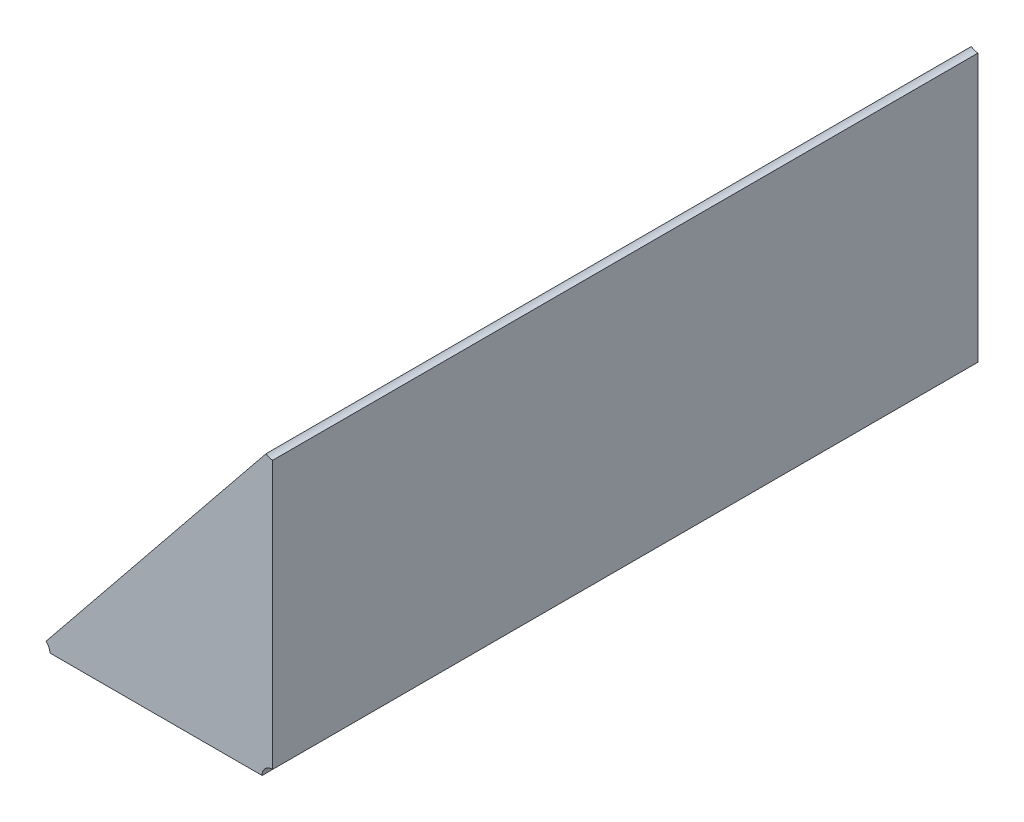
ISO-10303-21;
HEADER;
FILE_DESCRIPTION(('STEP AP214'),'2;1');
FILE_NAME('part.step','',(''),(''),'','','');
FILE_SCHEMA(('AUTOMOTIVE_DESIGN { 1 0 10303 214 1 1 1 1 }'));
ENDSEC;
DATA;
#1=APPLICATION_CONTEXT('core data for automotive mechanical design processes');
#2=APPLICATION_PROTOCOL_DEFINITION('international standard','automotive_design',2000,#1);
#3=PRODUCT_CONTEXT('',#1,'mechanical');
#4=PRODUCT('Part','Part','',(#3));
#5=PRODUCT_RELATED_PRODUCT_CATEGORY('part','',(#4));
#6=PRODUCT_DEFINITION_FORMATION('','',#4);
#7=PRODUCT_DEFINITION_CONTEXT('part definition',#1,'design');
#8=PRODUCT_DEFINITION('design','',#6,#7);
#9=PRODUCT_DEFINITION_SHAPE('','',#8);
#10=(LENGTH_UNIT() NAMED_UNIT(*) SI_UNIT(.MILLI.,.METRE.));
#11=(NAMED_UNIT(*) PLANE_ANGLE_UNIT() SI_UNIT($,.RADIAN.));
#12=(NAMED_UNIT(*) SI_UNIT($,.STERADIAN.) SOLID_ANGLE_UNIT());
#13=UNCERTAINTY_MEASURE_WITH_UNIT(LENGTH_MEASURE(1.E-05),#10,'distance_accuracy_value','');
#14=(GEOMETRIC_REPRESENTATION_CONTEXT(3) GLOBAL_UNCERTAINTY_ASSIGNED_CONTEXT((#13)) GLOBAL_UNIT_ASSIGNED_CONTEXT((#10,
#11,#12)) REPRESENTATION_CONTEXT('',''));
#15=CARTESIAN_POINT('',(0.,0.,0.));
#16=DIRECTION('',(0.,0.,1.));
#17=DIRECTION('',(1.,0.,0.));
#18=AXIS2_PLACEMENT_3D('',#15,#16,#17);
#19=CARTESIAN_POINT('',(-0.904883488962386,-0.778912469373211,0.1));
#20=DIRECTION('',(0.,0.,1.));
#21=DIRECTION('',(-1.,0.,0.));
#22=AXIS2_PLACEMENT_3D('',#19,#20,#21);
#23=CYLINDRICAL_SURFACE('',#22,0.0015);
#24=DIRECTION('',(0.,0.,1.));
#25=VECTOR('',#24,1.);
#26=CARTESIAN_POINT('',(-0.90394105514971,-0.777745499575518,0.));
#27=LINE('',#26,#25);
#28=CARTESIAN_POINT('',(-0.90394105514971,-0.777745499575518,0.));
#29=VERTEX_POINT('',#28);
#30=CARTESIAN_POINT('',(-0.90394105514971,-0.777745499575518,0.1));
#31=VERTEX_POINT('',#30);
#32=EDGE_CURVE('E11',#29,#31,#27,.T.);
#33=ORIENTED_EDGE('',*,*,#32,.F.);
#34=CARTESIAN_POINT('',(-0.904883488962386,-0.778912469373211,0.));
#35=DIRECTION('',(0.,0.,1.));
#36=DIRECTION('',(1.,0.,0.));
#37=AXIS2_PLACEMENT_3D('',#34,#35,#36);
#38=CIRCLE('',#37,0.0015);
#39=CARTESIAN_POINT('',(-0.903383488962386,-0.778912469373211,0.));
#40=VERTEX_POINT('',#39);
#41=EDGE_CURVE('E72',#40,#29,#38,.T.);
#42=ORIENTED_EDGE('',*,*,#41,.F.);
#43=DIRECTION('',(0.,0.,-1.));
#44=VECTOR('',#43,1.);
#45=CARTESIAN_POINT('',(-0.903383488962386,-0.778912469373211,0.1));
#46=LINE('',#45,#44);
#47=CARTESIAN_POINT('',(-0.903383488962386,-0.778912469373211,0.1));
#48=VERTEX_POINT('',#47);
#49=EDGE_CURVE('E94',#48,#40,#46,.T.);
#50=ORIENTED_EDGE('',*,*,#49,.F.);
#51=CARTESIAN_POINT('',(-0.904883488962386,-0.778912469373211,0.1));
#52=DIRECTION('',(0.,0.,-1.));
#53=DIRECTION('',(0.628289208450276,0.777979865128222,0.));
#54=AXIS2_PLACEMENT_3D('',#51,#52,#53);
#55=CIRCLE('',#54,0.0015);
#56=EDGE_CURVE('E112',#31,#48,#55,.T.);
#57=ORIENTED_EDGE('',*,*,#56,.F.);
#58=EDGE_LOOP('',(#33,#42,#50,#57));
#59=FACE_BOUND('',#58,.T.);
#60=ADVANCED_FACE('F17',(#59),#23,.F.);
#61=CARTESIAN_POINT('',(-0.871804418110991,-0.778912469373211,0.1));
#62=DIRECTION('',(0.,0.,1.));
#63=DIRECTION('',(-1.,0.,0.));
#64=AXIS2_PLACEMENT_3D('',#61,#62,#63);
#65=CYLINDRICAL_SURFACE('',#64,0.0015);
#66=DIRECTION('',(0.,0.,-1.));
#67=VECTOR('',#66,1.);
#68=CARTESIAN_POINT('',(-0.871804418110991,-0.777412469373211,0.1));
#69=LINE('',#68,#67);
#70=CARTESIAN_POINT('',(-0.871804418110991,-0.777412469373211,0.1));
#71=VERTEX_POINT('',#70);
#72=CARTESIAN_POINT('',(-0.871804418110991,-0.777412469373211,0.));
#73=VERTEX_POINT('',#72);
#74=EDGE_CURVE('E24',#71,#73,#69,.T.);
#75=ORIENTED_EDGE('',*,*,#74,.F.);
#76=CARTESIAN_POINT('',(-0.871804418110991,-0.778912469373211,0.1));
#77=DIRECTION('',(0.,0.,-1.));
#78=DIRECTION('',(-1.,0.,0.));
#79=AXIS2_PLACEMENT_3D('',#76,#77,#78);
#80=CIRCLE('',#79,0.0015);
#81=CARTESIAN_POINT('',(-0.873304418110991,-0.778912469373211,0.1));
#82=VERTEX_POINT('',#81);
#83=EDGE_CURVE('E90',#82,#71,#80,.T.);
#84=ORIENTED_EDGE('',*,*,#83,.F.);
#85=DIRECTION('',(0.,0.,1.));
#86=VECTOR('',#85,1.);
#87=CARTESIAN_POINT('',(-0.873304418110991,-0.778912469373211,0.));
#88=LINE('',#87,#86);
#89=CARTESIAN_POINT('',(-0.873304418110991,-0.778912469373211,0.));
#90=VERTEX_POINT('',#89);
#91=EDGE_CURVE('E115',#90,#82,#88,.T.);
#92=ORIENTED_EDGE('',*,*,#91,.F.);
#93=CARTESIAN_POINT('',(-0.871804418110991,-0.778912469373211,0.));
#94=DIRECTION('',(0.,0.,1.));
#95=DIRECTION('',(0.,1.,0.));
#96=AXIS2_PLACEMENT_3D('',#93,#94,#95);
#97=CIRCLE('',#96,0.0015);
#98=EDGE_CURVE('E75',#73,#90,#97,.T.);
#99=ORIENTED_EDGE('',*,*,#98,.F.);
#100=EDGE_LOOP('',(#75,#84,#92,#99));
#101=FACE_BOUND('',#100,.T.);
#102=ADVANCED_FACE('F127',(#101),#65,.F.);
#103=CARTESIAN_POINT('',(-0.871804418110991,-0.737952270258831,0.1));
#104=DIRECTION('',(0.,0.,1.));
#105=DIRECTION('',(-1.,0.,0.));
#106=AXIS2_PLACEMENT_3D('',#103,#104,#105);
#107=CYLINDRICAL_SURFACE('',#106,0.0015);
#108=DIRECTION('',(0.,0.,-1.));
#109=VECTOR('',#108,1.);
#110=CARTESIAN_POINT('',(-0.872746851923666,-0.739119240056523,0.1));
#111=LINE('',#110,#109);
#112=CARTESIAN_POINT('',(-0.872746851923666,-0.739119240056523,0.1));
#113=VERTEX_POINT('',#112);
#114=CARTESIAN_POINT('',(-0.872746851923666,-0.739119240056523,0.));
#115=VERTEX_POINT('',#114);
#116=EDGE_CURVE('E79',#113,#115,#111,.T.);
#117=ORIENTED_EDGE('',*,*,#116,.F.);
#118=CARTESIAN_POINT('',(-0.871804418110991,-0.737952270258831,0.1));
#119=DIRECTION('',(0.,0.,-1.));
#120=DIRECTION('',(0.,-1.,0.));
#121=AXIS2_PLACEMENT_3D('',#118,#119,#120);
#122=CIRCLE('',#121,0.0015);
#123=CARTESIAN_POINT('',(-0.871804418110991,-0.739452270258831,0.1));
#124=VERTEX_POINT('',#123);
#125=EDGE_CURVE('E118',#124,#113,#122,.T.);
#126=ORIENTED_EDGE('',*,*,#125,.F.);
#127=DIRECTION('',(0.,0.,1.));
#128=VECTOR('',#127,1.);
#129=CARTESIAN_POINT('',(-0.871804418110991,-0.739452270258831,0.));
#130=LINE('',#129,#128);
#131=CARTESIAN_POINT('',(-0.871804418110991,-0.739452270258831,0.));
#132=VERTEX_POINT('',#131);
#133=EDGE_CURVE('E82',#132,#124,#130,.T.);
#134=ORIENTED_EDGE('',*,*,#133,.F.);
#135=CARTESIAN_POINT('',(-0.871804418110991,-0.737952270258831,0.));
#136=DIRECTION('',(0.,0.,1.));
#137=DIRECTION('',(-0.628289208450231,-0.777979865128258,0.));
#138=AXIS2_PLACEMENT_3D('',#135,#136,#137);
#139=CIRCLE('',#138,0.0015);
#140=EDGE_CURVE('E70',#115,#132,#139,.T.);
#141=ORIENTED_EDGE('',*,*,#140,.F.);
#142=EDGE_LOOP('',(#117,#126,#134,#141));
#143=FACE_BOUND('',#142,.T.);
#144=ADVANCED_FACE('F78',(#143),#107,.F.);
#145=CARTESIAN_POINT('',(-0.871804418110991,-0.778912469373211,0.));
#146=DIRECTION('',(0.,1.,0.));
#147=DIRECTION('',(-1.,0.,0.));
#148=AXIS2_PLACEMENT_3D('',#145,#146,#147);
#149=PLANE('',#148);
#150=ORIENTED_EDGE('',*,*,#49,.T.);
#151=DIRECTION('',(-1.,0.,0.));
#152=VECTOR('',#151,1.);
#153=CARTESIAN_POINT('',(-0.873304418110991,-0.778912469373211,0.));
#154=LINE('',#153,#152);
#155=EDGE_CURVE('E110',#90,#40,#154,.T.);
#156=ORIENTED_EDGE('',*,*,#155,.F.);
#157=ORIENTED_EDGE('',*,*,#91,.T.);
#158=DIRECTION('',(-1.,0.,0.));
#159=VECTOR('',#158,1.);
#160=CARTESIAN_POINT('',(-0.873304418110991,-0.778912469373211,0.1));
#161=LINE('',#160,#159);
#162=EDGE_CURVE('E102',#82,#48,#161,.T.);
#163=ORIENTED_EDGE('',*,*,#162,.T.);
#164=EDGE_LOOP('',(#150,#156,#157,#163));
#165=FACE_BOUND('',#164,.T.);
#166=ADVANCED_FACE('F122',(#165),#149,.F.);
#167=CARTESIAN_POINT('',(-0.882996494401276,-0.763779828951434,0.));
#168=DIRECTION('',(0.,0.,-1.));
#169=DIRECTION('',(-1.,0.,0.));
#170=AXIS2_PLACEMENT_3D('',#167,#168,#169);
#171=PLANE('',#170);
#172=ORIENTED_EDGE('',*,*,#41,.T.);
#173=DIRECTION('',(0.62828920845021,0.777979865128275,0.));
#174=VECTOR('',#173,1.);
#175=CARTESIAN_POINT('',(-0.90394105514971,-0.777745499575518,0.));
#176=LINE('',#175,#174);
#177=EDGE_CURVE('E66',#29,#115,#176,.T.);
#178=ORIENTED_EDGE('',*,*,#177,.T.);
#179=ORIENTED_EDGE('',*,*,#140,.T.);
#180=DIRECTION('',(0.,-1.,0.));
#181=VECTOR('',#180,1.);
#182=CARTESIAN_POINT('',(-0.871804418110991,-0.739452270258831,0.));
#183=LINE('',#182,#181);
#184=EDGE_CURVE('E84',#132,#73,#183,.T.);
#185=ORIENTED_EDGE('',*,*,#184,.T.);
#186=ORIENTED_EDGE('',*,*,#98,.T.);
#187=ORIENTED_EDGE('',*,*,#155,.T.);
#188=EDGE_LOOP('',(#172,#178,#179,#185,#186,#187));
#189=FACE_BOUND('',#188,.T.);
#190=ADVANCED_FACE('F68',(#189),#171,.T.);
#191=CARTESIAN_POINT('',(-0.871804418110991,-0.737952270258831,0.));
#192=DIRECTION('',(-1.,0.,0.));
#193=DIRECTION('',(0.,-1.,0.));
#194=AXIS2_PLACEMENT_3D('',#191,#192,#193);
#195=PLANE('',#194);
#196=ORIENTED_EDGE('',*,*,#74,.T.);
#197=ORIENTED_EDGE('',*,*,#184,.F.);
#198=ORIENTED_EDGE('',*,*,#133,.T.);
#199=DIRECTION('',(0.,-1.,0.));
#200=VECTOR('',#199,1.);
#201=CARTESIAN_POINT('',(-0.871804418110991,-0.739452270258831,0.1));
#202=LINE('',#201,#200);
#203=EDGE_CURVE('E100',#124,#71,#202,.T.);
#204=ORIENTED_EDGE('',*,*,#203,.T.);
#205=EDGE_LOOP('',(#196,#197,#198,#204));
#206=FACE_BOUND('',#205,.T.);
#207=ADVANCED_FACE('F98',(#206),#195,.F.);
#208=CARTESIAN_POINT('',(-0.904883488962386,-0.778912469373211,0.));
#209=DIRECTION('',(0.777979865128274,-0.628289208450211,0.));
#210=DIRECTION('',(0.628289208450211,0.777979865128274,0.));
#211=AXIS2_PLACEMENT_3D('',#208,#209,#210);
#212=PLANE('',#211);
#213=ORIENTED_EDGE('',*,*,#32,.T.);
#214=DIRECTION('',(0.62828920845021,0.777979865128275,0.));
#215=VECTOR('',#214,1.);
#216=CARTESIAN_POINT('',(-0.90394105514971,-0.777745499575518,0.1));
#217=LINE('',#216,#215);
#218=EDGE_CURVE('E88',#31,#113,#217,.T.);
#219=ORIENTED_EDGE('',*,*,#218,.T.);
#220=ORIENTED_EDGE('',*,*,#116,.T.);
#221=ORIENTED_EDGE('',*,*,#177,.F.);
#222=EDGE_LOOP('',(#213,#219,#220,#221));
#223=FACE_BOUND('',#222,.T.);
#224=ADVANCED_FACE('F86',(#223),#212,.F.);
#225=CARTESIAN_POINT('',(-0.882996494401276,-0.763779828951434,0.1));
#226=DIRECTION('',(0.,0.,-1.));
#227=DIRECTION('',(-1.,0.,0.));
#228=AXIS2_PLACEMENT_3D('',#225,#226,#227);
#229=PLANE('',#228);
#230=ORIENTED_EDGE('',*,*,#56,.T.);
#231=ORIENTED_EDGE('',*,*,#162,.F.);
#232=ORIENTED_EDGE('',*,*,#83,.T.);
#233=ORIENTED_EDGE('',*,*,#203,.F.);
#234=ORIENTED_EDGE('',*,*,#125,.T.);
#235=ORIENTED_EDGE('',*,*,#218,.F.);
#236=EDGE_LOOP('',(#230,#231,#232,#233,#234,#235));
#237=FACE_BOUND('',#236,.T.);
#238=ADVANCED_FACE('F125',(#237),#229,.F.);
#239=CLOSED_SHELL('',(#60,#102,#144,#166,#190,#207,#224,#238));
#240=MANIFOLD_SOLID_BREP('B1',#239);
#241=ADVANCED_BREP_SHAPE_REPRESENTATION('',(#18,#240),#14);
#242=SHAPE_DEFINITION_REPRESENTATION(#9,#241);
ENDSEC;
END-ISO-10303-21;
